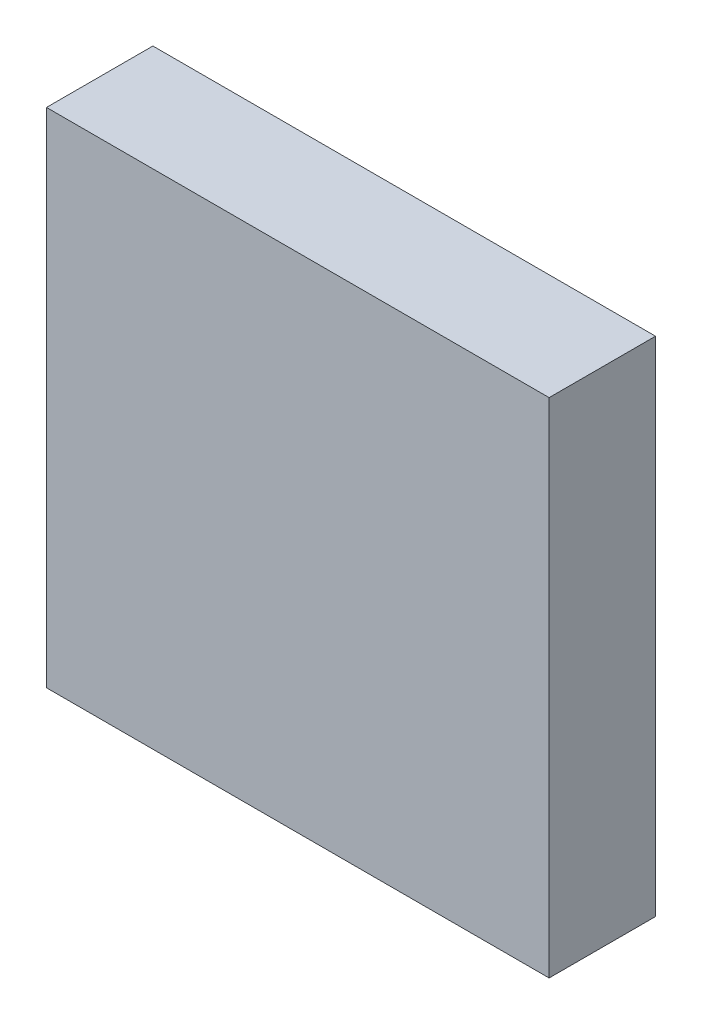
ISO-10303-21;
HEADER;
FILE_DESCRIPTION(('STEP AP214'),'2;1');
FILE_NAME('part.step','',(''),(''),'','','');
FILE_SCHEMA(('AUTOMOTIVE_DESIGN { 1 0 10303 214 1 1 1 1 }'));
ENDSEC;
DATA;
#1=APPLICATION_CONTEXT('core data for automotive mechanical design processes');
#2=APPLICATION_PROTOCOL_DEFINITION('international standard','automotive_design',2000,#1);
#3=PRODUCT_CONTEXT('',#1,'mechanical');
#4=PRODUCT('Part','Part','',(#3));
#5=PRODUCT_RELATED_PRODUCT_CATEGORY('part','',(#4));
#6=PRODUCT_DEFINITION_FORMATION('','',#4);
#7=PRODUCT_DEFINITION_CONTEXT('part definition',#1,'design');
#8=PRODUCT_DEFINITION('design','',#6,#7);
#9=PRODUCT_DEFINITION_SHAPE('','',#8);
#10=(LENGTH_UNIT() NAMED_UNIT(*) SI_UNIT(.MILLI.,.METRE.));
#11=(NAMED_UNIT(*) PLANE_ANGLE_UNIT() SI_UNIT($,.RADIAN.));
#12=(NAMED_UNIT(*) SI_UNIT($,.STERADIAN.) SOLID_ANGLE_UNIT());
#13=UNCERTAINTY_MEASURE_WITH_UNIT(LENGTH_MEASURE(1.E-05),#10,'distance_accuracy_value','');
#14=(GEOMETRIC_REPRESENTATION_CONTEXT(3) GLOBAL_UNCERTAINTY_ASSIGNED_CONTEXT((#13)) GLOBAL_UNIT_ASSIGNED_CONTEXT((#10,
#11,#12)) REPRESENTATION_CONTEXT('',''));
#15=CARTESIAN_POINT('',(0.,0.,0.));
#16=DIRECTION('',(0.,0.,1.));
#17=DIRECTION('',(1.,0.,0.));
#18=AXIS2_PLACEMENT_3D('',#15,#16,#17);
#19=CARTESIAN_POINT('',(0.,0.,6.35));
#20=DIRECTION('',(1.,0.,0.));
#21=DIRECTION('',(0.,1.,0.));
#22=AXIS2_PLACEMENT_3D('',#19,#20,#21);
#23=PLANE('',#22);
#24=DIRECTION('',(0.,-1.,0.));
#25=VECTOR('',#24,1.);
#26=CARTESIAN_POINT('',(0.,0.,0.));
#27=LINE('',#26,#25);
#28=CARTESIAN_POINT('',(0.,30.,0.));
#29=VERTEX_POINT('',#28);
#30=CARTESIAN_POINT('',(0.,0.,0.));
#31=VERTEX_POINT('',#30);
#32=EDGE_CURVE('E96',#29,#31,#27,.T.);
#33=ORIENTED_EDGE('',*,*,#32,.T.);
#34=DIRECTION('',(0.,0.,-1.));
#35=VECTOR('',#34,1.);
#36=CARTESIAN_POINT('',(0.,0.,6.35));
#37=LINE('',#36,#35);
#38=CARTESIAN_POINT('',(0.,0.,6.35));
#39=VERTEX_POINT('',#38);
#40=EDGE_CURVE('E11',#39,#31,#37,.T.);
#41=ORIENTED_EDGE('',*,*,#40,.F.);
#42=DIRECTION('',(0.,-1.,0.));
#43=VECTOR('',#42,1.);
#44=CARTESIAN_POINT('',(0.,0.,6.35));
#45=LINE('',#44,#43);
#46=CARTESIAN_POINT('',(0.,30.,6.35));
#47=VERTEX_POINT('',#46);
#48=EDGE_CURVE('E84',#47,#39,#45,.T.);
#49=ORIENTED_EDGE('',*,*,#48,.F.);
#50=DIRECTION('',(0.,0.,-1.));
#51=VECTOR('',#50,1.);
#52=CARTESIAN_POINT('',(0.,30.,6.35));
#53=LINE('',#52,#51);
#54=EDGE_CURVE('E92',#47,#29,#53,.T.);
#55=ORIENTED_EDGE('',*,*,#54,.T.);
#56=EDGE_LOOP('',(#33,#41,#49,#55));
#57=FACE_BOUND('',#56,.T.);
#58=ADVANCED_FACE('F33',(#57),#23,.F.);
#59=CARTESIAN_POINT('',(0.,0.,6.35));
#60=DIRECTION('',(0.,1.,0.));
#61=DIRECTION('',(0.,0.,1.));
#62=AXIS2_PLACEMENT_3D('',#59,#60,#61);
#63=PLANE('',#62);
#64=DIRECTION('',(1.,0.,0.));
#65=VECTOR('',#64,1.);
#66=CARTESIAN_POINT('',(0.,0.,0.));
#67=LINE('',#66,#65);
#68=CARTESIAN_POINT('',(30.,0.,0.));
#69=VERTEX_POINT('',#68);
#70=EDGE_CURVE('E88',#31,#69,#67,.T.);
#71=ORIENTED_EDGE('',*,*,#70,.T.);
#72=DIRECTION('',(0.,0.,-1.));
#73=VECTOR('',#72,1.);
#74=CARTESIAN_POINT('',(30.,0.,6.35));
#75=LINE('',#74,#73);
#76=CARTESIAN_POINT('',(30.,0.,6.35));
#77=VERTEX_POINT('',#76);
#78=EDGE_CURVE('E41',#77,#69,#75,.T.);
#79=ORIENTED_EDGE('',*,*,#78,.F.);
#80=DIRECTION('',(1.,0.,0.));
#81=VECTOR('',#80,1.);
#82=CARTESIAN_POINT('',(0.,0.,6.35));
#83=LINE('',#82,#81);
#84=EDGE_CURVE('E79',#39,#77,#83,.T.);
#85=ORIENTED_EDGE('',*,*,#84,.F.);
#86=ORIENTED_EDGE('',*,*,#40,.T.);
#87=EDGE_LOOP('',(#71,#79,#85,#86));
#88=FACE_BOUND('',#87,.T.);
#89=ADVANCED_FACE('F87',(#88),#63,.F.);
#90=CARTESIAN_POINT('',(30.,0.,6.35));
#91=DIRECTION('',(-1.,0.,0.));
#92=DIRECTION('',(0.,-1.,0.));
#93=AXIS2_PLACEMENT_3D('',#90,#91,#92);
#94=PLANE('',#93);
#95=DIRECTION('',(0.,1.,0.));
#96=VECTOR('',#95,1.);
#97=CARTESIAN_POINT('',(30.,0.,0.));
#98=LINE('',#97,#96);
#99=CARTESIAN_POINT('',(30.,30.,0.));
#100=VERTEX_POINT('',#99);
#101=EDGE_CURVE('E66',#69,#100,#98,.T.);
#102=ORIENTED_EDGE('',*,*,#101,.T.);
#103=DIRECTION('',(0.,0.,-1.));
#104=VECTOR('',#103,1.);
#105=CARTESIAN_POINT('',(30.,30.,6.35));
#106=LINE('',#105,#104);
#107=CARTESIAN_POINT('',(30.,30.,6.35));
#108=VERTEX_POINT('',#107);
#109=EDGE_CURVE('E89',#108,#100,#106,.T.);
#110=ORIENTED_EDGE('',*,*,#109,.F.);
#111=DIRECTION('',(0.,1.,0.));
#112=VECTOR('',#111,1.);
#113=CARTESIAN_POINT('',(30.,0.,6.35));
#114=LINE('',#113,#112);
#115=EDGE_CURVE('E82',#77,#108,#114,.T.);
#116=ORIENTED_EDGE('',*,*,#115,.F.);
#117=ORIENTED_EDGE('',*,*,#78,.T.);
#118=EDGE_LOOP('',(#102,#110,#116,#117));
#119=FACE_BOUND('',#118,.T.);
#120=ADVANCED_FACE('F90',(#119),#94,.F.);
#121=CARTESIAN_POINT('',(0.,30.,6.35));
#122=DIRECTION('',(0.,-1.,0.));
#123=DIRECTION('',(0.,0.,-1.));
#124=AXIS2_PLACEMENT_3D('',#121,#122,#123);
#125=PLANE('',#124);
#126=DIRECTION('',(-1.,0.,0.));
#127=VECTOR('',#126,1.);
#128=CARTESIAN_POINT('',(0.,30.,0.));
#129=LINE('',#128,#127);
#130=EDGE_CURVE('E72',#100,#29,#129,.T.);
#131=ORIENTED_EDGE('',*,*,#130,.T.);
#132=ORIENTED_EDGE('',*,*,#54,.F.);
#133=DIRECTION('',(-1.,0.,0.));
#134=VECTOR('',#133,1.);
#135=CARTESIAN_POINT('',(0.,30.,6.35));
#136=LINE('',#135,#134);
#137=EDGE_CURVE('E49',#108,#47,#136,.T.);
#138=ORIENTED_EDGE('',*,*,#137,.F.);
#139=ORIENTED_EDGE('',*,*,#109,.T.);
#140=EDGE_LOOP('',(#131,#132,#138,#139));
#141=FACE_BOUND('',#140,.T.);
#142=ADVANCED_FACE('F103',(#141),#125,.F.);
#143=CARTESIAN_POINT('',(0.,30.,6.35));
#144=DIRECTION('',(0.,0.,-1.));
#145=DIRECTION('',(-1.,0.,0.));
#146=AXIS2_PLACEMENT_3D('',#143,#144,#145);
#147=PLANE('',#146);
#148=ORIENTED_EDGE('',*,*,#48,.T.);
#149=ORIENTED_EDGE('',*,*,#84,.T.);
#150=ORIENTED_EDGE('',*,*,#115,.T.);
#151=ORIENTED_EDGE('',*,*,#137,.T.);
#152=EDGE_LOOP('',(#148,#149,#150,#151));
#153=FACE_BOUND('',#152,.T.);
#154=ADVANCED_FACE('F80',(#153),#147,.F.);
#155=CARTESIAN_POINT('',(0.,30.,0.));
#156=DIRECTION('',(0.,0.,-1.));
#157=DIRECTION('',(-1.,0.,0.));
#158=AXIS2_PLACEMENT_3D('',#155,#156,#157);
#159=PLANE('',#158);
#160=ORIENTED_EDGE('',*,*,#32,.F.);
#161=ORIENTED_EDGE('',*,*,#130,.F.);
#162=ORIENTED_EDGE('',*,*,#101,.F.);
#163=ORIENTED_EDGE('',*,*,#70,.F.);
#164=EDGE_LOOP('',(#160,#161,#162,#163));
#165=FACE_BOUND('',#164,.T.);
#166=ADVANCED_FACE('F106',(#165),#159,.T.);
#167=CLOSED_SHELL('',(#58,#89,#120,#142,#154,#166));
#168=MANIFOLD_SOLID_BREP('B2',#167);
#169=ADVANCED_BREP_SHAPE_REPRESENTATION('',(#18,#168),#14);
#170=SHAPE_DEFINITION_REPRESENTATION(#9,#169);
ENDSEC;
END-ISO-10303-21;
